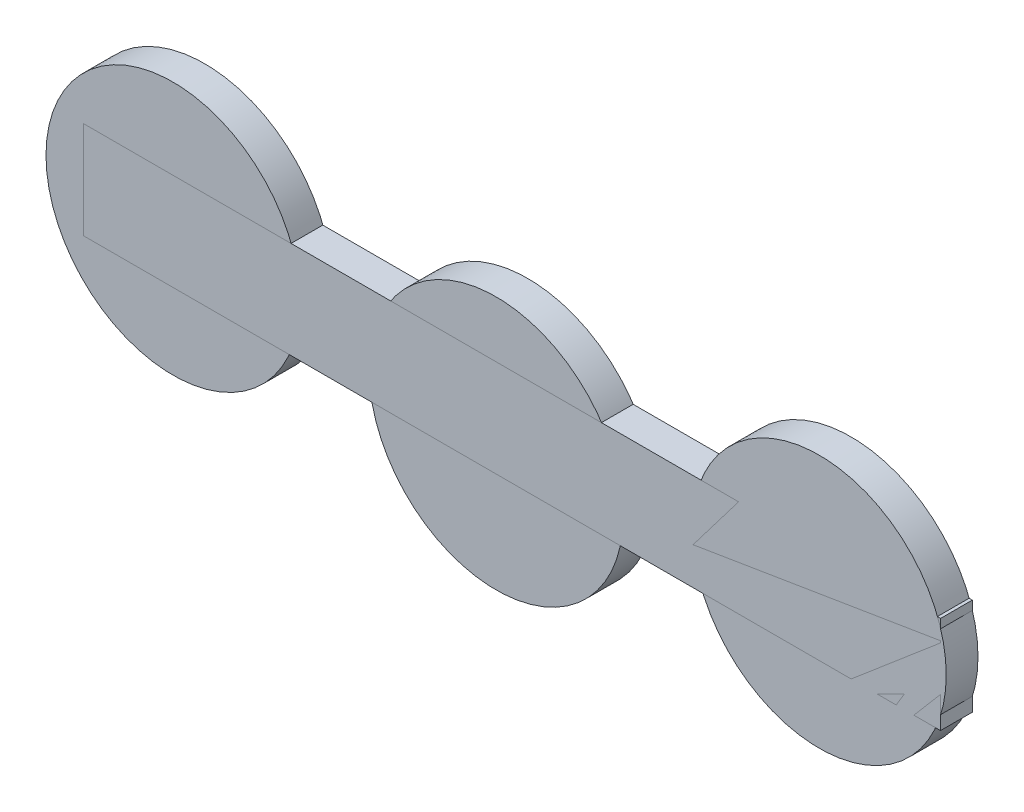
ISO-10303-21;
HEADER;
FILE_DESCRIPTION(('STEP AP214'),'2;1');
FILE_NAME('part.step','',(''),(''),'','','');
FILE_SCHEMA(('AUTOMOTIVE_DESIGN { 1 0 10303 214 1 1 1 1 }'));
ENDSEC;
DATA;
#1=APPLICATION_CONTEXT('core data for automotive mechanical design processes');
#2=APPLICATION_PROTOCOL_DEFINITION('international standard','automotive_design',2000,#1);
#3=PRODUCT_CONTEXT('',#1,'mechanical');
#4=PRODUCT('Part','Part','',(#3));
#5=PRODUCT_RELATED_PRODUCT_CATEGORY('part','',(#4));
#6=PRODUCT_DEFINITION_FORMATION('','',#4);
#7=PRODUCT_DEFINITION_CONTEXT('part definition',#1,'design');
#8=PRODUCT_DEFINITION('design','',#6,#7);
#9=PRODUCT_DEFINITION_SHAPE('','',#8);
#10=(LENGTH_UNIT() NAMED_UNIT(*) SI_UNIT(.MILLI.,.METRE.));
#11=(NAMED_UNIT(*) PLANE_ANGLE_UNIT() SI_UNIT($,.RADIAN.));
#12=(NAMED_UNIT(*) SI_UNIT($,.STERADIAN.) SOLID_ANGLE_UNIT());
#13=UNCERTAINTY_MEASURE_WITH_UNIT(LENGTH_MEASURE(1.E-05),#10,'distance_accuracy_value','');
#14=(GEOMETRIC_REPRESENTATION_CONTEXT(3) GLOBAL_UNCERTAINTY_ASSIGNED_CONTEXT((#13)) GLOBAL_UNIT_ASSIGNED_CONTEXT((#10,
#11,#12)) REPRESENTATION_CONTEXT('',''));
#15=CARTESIAN_POINT('',(0.,0.,0.));
#16=DIRECTION('',(0.,0.,1.));
#17=DIRECTION('',(1.,0.,0.));
#18=AXIS2_PLACEMENT_3D('',#15,#16,#17);
#19=CARTESIAN_POINT('',(-0.762000000000318,-81.1529999999999,25.4));
#20=DIRECTION('',(-1.,0.,0.));
#21=DIRECTION('',(0.,0.,1.));
#22=AXIS2_PLACEMENT_3D('',#19,#20,#21);
#23=PLANE('',#22);
#24=DIRECTION('',(0.,1.,0.));
#25=VECTOR('',#24,1.);
#26=CARTESIAN_POINT('',(-0.762000000000318,-81.1529999999999,0.));
#27=LINE('',#26,#25);
#28=CARTESIAN_POINT('',(-0.762000000000318,-81.1529999999999,0.));
#29=VERTEX_POINT('',#28);
#30=CARTESIAN_POINT('',(-0.762000000000318,-3.4289999999999,0.));
#31=VERTEX_POINT('',#30);
#32=EDGE_CURVE('E107',#29,#31,#27,.T.);
#33=ORIENTED_EDGE('',*,*,#32,.T.);
#34=DIRECTION('',(0.,0.,-1.));
#35=VECTOR('',#34,1.);
#36=CARTESIAN_POINT('',(-0.762000000000318,-3.4289999999999,25.4));
#37=LINE('',#36,#35);
#38=CARTESIAN_POINT('',(-0.762000000000318,-3.4289999999999,25.4));
#39=VERTEX_POINT('',#38);
#40=EDGE_CURVE('E12',#39,#31,#37,.T.);
#41=ORIENTED_EDGE('',*,*,#40,.F.);
#42=DIRECTION('',(0.,1.,0.));
#43=VECTOR('',#42,1.);
#44=CARTESIAN_POINT('',(-0.762000000000318,-81.1529999999999,25.4));
#45=LINE('',#44,#43);
#46=CARTESIAN_POINT('',(-0.762000000000318,-81.1529999999999,25.4));
#47=VERTEX_POINT('',#46);
#48=EDGE_CURVE('E95',#47,#39,#45,.T.);
#49=ORIENTED_EDGE('',*,*,#48,.F.);
#50=DIRECTION('',(0.,0.,-1.));
#51=VECTOR('',#50,1.);
#52=CARTESIAN_POINT('',(-0.762000000000318,-81.1529999999999,25.4));
#53=LINE('',#52,#51);
#54=EDGE_CURVE('E103',#47,#29,#53,.T.);
#55=ORIENTED_EDGE('',*,*,#54,.T.);
#56=EDGE_LOOP('',(#33,#41,#49,#55));
#57=FACE_BOUND('',#56,.T.);
#58=ADVANCED_FACE('F44',(#57),#23,.F.);
#59=CARTESIAN_POINT('',(-0.762000000000318,-3.4289999999999,25.4));
#60=DIRECTION('',(0.,-1.,0.));
#61=DIRECTION('',(1.,0.,0.));
#62=AXIS2_PLACEMENT_3D('',#59,#60,#61);
#63=PLANE('',#62);
#64=DIRECTION('',(-1.,0.,0.));
#65=VECTOR('',#64,1.);
#66=CARTESIAN_POINT('',(-0.762000000000318,-3.4289999999999,0.));
#67=LINE('',#66,#65);
#68=CARTESIAN_POINT('',(-686.562,-3.42899999999999,0.));
#69=VERTEX_POINT('',#68);
#70=EDGE_CURVE('E99',#31,#69,#67,.T.);
#71=ORIENTED_EDGE('',*,*,#70,.T.);
#72=DIRECTION('',(0.,0.,-1.));
#73=VECTOR('',#72,1.);
#74=CARTESIAN_POINT('',(-686.562,-3.42899999999999,25.4));
#75=LINE('',#74,#73);
#76=CARTESIAN_POINT('',(-686.562,-3.42899999999999,25.4));
#77=VERTEX_POINT('',#76);
#78=EDGE_CURVE('E52',#77,#69,#75,.T.);
#79=ORIENTED_EDGE('',*,*,#78,.F.);
#80=DIRECTION('',(-1.,0.,0.));
#81=VECTOR('',#80,1.);
#82=CARTESIAN_POINT('',(-0.762000000000318,-3.4289999999999,25.4));
#83=LINE('',#82,#81);
#84=EDGE_CURVE('E90',#39,#77,#83,.T.);
#85=ORIENTED_EDGE('',*,*,#84,.F.);
#86=ORIENTED_EDGE('',*,*,#40,.T.);
#87=EDGE_LOOP('',(#71,#79,#85,#86));
#88=FACE_BOUND('',#87,.T.);
#89=ADVANCED_FACE('F98',(#88),#63,.F.);
#90=CARTESIAN_POINT('',(-686.562,-81.153,25.4));
#91=DIRECTION('',(1.,0.,0.));
#92=DIRECTION('',(0.,1.,0.));
#93=AXIS2_PLACEMENT_3D('',#90,#91,#92);
#94=PLANE('',#93);
#95=DIRECTION('',(0.,-1.,0.));
#96=VECTOR('',#95,1.);
#97=CARTESIAN_POINT('',(-686.562,-81.153,0.));
#98=LINE('',#97,#96);
#99=CARTESIAN_POINT('',(-686.562,-81.153,0.));
#100=VERTEX_POINT('',#99);
#101=EDGE_CURVE('E77',#69,#100,#98,.T.);
#102=ORIENTED_EDGE('',*,*,#101,.T.);
#103=DIRECTION('',(0.,0.,-1.));
#104=VECTOR('',#103,1.);
#105=CARTESIAN_POINT('',(-686.562,-81.153,25.4));
#106=LINE('',#105,#104);
#107=CARTESIAN_POINT('',(-686.562,-81.153,25.4));
#108=VERTEX_POINT('',#107);
#109=EDGE_CURVE('E100',#108,#100,#106,.T.);
#110=ORIENTED_EDGE('',*,*,#109,.F.);
#111=DIRECTION('',(0.,-1.,0.));
#112=VECTOR('',#111,1.);
#113=CARTESIAN_POINT('',(-686.562,-81.153,25.4));
#114=LINE('',#113,#112);
#115=EDGE_CURVE('E93',#77,#108,#114,.T.);
#116=ORIENTED_EDGE('',*,*,#115,.F.);
#117=ORIENTED_EDGE('',*,*,#78,.T.);
#118=EDGE_LOOP('',(#102,#110,#116,#117));
#119=FACE_BOUND('',#118,.T.);
#120=ADVANCED_FACE('F101',(#119),#94,.F.);
#121=CARTESIAN_POINT('',(-0.762000000000318,-81.1529999999999,25.4));
#122=DIRECTION('',(0.,1.,0.));
#123=DIRECTION('',(-1.,0.,0.));
#124=AXIS2_PLACEMENT_3D('',#121,#122,#123);
#125=PLANE('',#124);
#126=DIRECTION('',(1.,0.,0.));
#127=VECTOR('',#126,1.);
#128=CARTESIAN_POINT('',(-0.762000000000318,-81.1529999999999,0.));
#129=LINE('',#128,#127);
#130=EDGE_CURVE('E83',#100,#29,#129,.T.);
#131=ORIENTED_EDGE('',*,*,#130,.T.);
#132=ORIENTED_EDGE('',*,*,#54,.F.);
#133=DIRECTION('',(1.,0.,0.));
#134=VECTOR('',#133,1.);
#135=CARTESIAN_POINT('',(-0.762000000000318,-81.1529999999999,25.4));
#136=LINE('',#135,#134);
#137=EDGE_CURVE('E60',#108,#47,#136,.T.);
#138=ORIENTED_EDGE('',*,*,#137,.F.);
#139=ORIENTED_EDGE('',*,*,#109,.T.);
#140=EDGE_LOOP('',(#131,#132,#138,#139));
#141=FACE_BOUND('',#140,.T.);
#142=ADVANCED_FACE('F114',(#141),#125,.F.);
#143=CARTESIAN_POINT('',(0.,0.,25.4));
#144=DIRECTION('',(0.,0.,1.));
#145=DIRECTION('',(1.,0.,0.));
#146=AXIS2_PLACEMENT_3D('',#143,#144,#145);
#147=PLANE('',#146);
#148=ORIENTED_EDGE('',*,*,#48,.T.);
#149=ORIENTED_EDGE('',*,*,#84,.T.);
#150=ORIENTED_EDGE('',*,*,#115,.T.);
#151=ORIENTED_EDGE('',*,*,#137,.T.);
#152=EDGE_LOOP('',(#148,#149,#150,#151));
#153=FACE_BOUND('',#152,.T.);
#154=ADVANCED_FACE('F91',(#153),#147,.T.);
#155=CARTESIAN_POINT('',(0.,0.,0.));
#156=DIRECTION('',(0.,0.,1.));
#157=DIRECTION('',(1.,0.,0.));
#158=AXIS2_PLACEMENT_3D('',#155,#156,#157);
#159=PLANE('',#158);
#160=ORIENTED_EDGE('',*,*,#32,.F.);
#161=ORIENTED_EDGE('',*,*,#130,.F.);
#162=ORIENTED_EDGE('',*,*,#101,.F.);
#163=ORIENTED_EDGE('',*,*,#70,.F.);
#164=EDGE_LOOP('',(#160,#161,#162,#163));
#165=FACE_BOUND('',#164,.T.);
#166=ADVANCED_FACE('F117',(#165),#159,.F.);
#167=CLOSED_SHELL('',(#58,#89,#120,#142,#154,#166));
#168=MANIFOLD_SOLID_BREP('B2',#167);
#169=CARTESIAN_POINT('',(-614.932837167686,-40.3859999999998,25.4));
#170=DIRECTION('',(0.,0.,-1.));
#171=DIRECTION('',(-1.,0.,0.));
#172=AXIS2_PLACEMENT_3D('',#169,#170,#171);
#173=CYLINDRICAL_SURFACE('',#172,101.6);
#174=CARTESIAN_POINT('',(-614.932837167686,-40.3859999999998,25.4));
#175=DIRECTION('',(0.,0.,1.));
#176=DIRECTION('',(1.,0.,0.));
#177=AXIS2_PLACEMENT_3D('',#174,#175,#176);
#178=CIRCLE('',#177,101.6);
#179=CARTESIAN_POINT('',(-513.332837167686,-40.3859999999998,25.4));
#180=VERTEX_POINT('',#179);
#181=EDGE_CURVE('E43',#180,#180,#178,.T.);
#182=ORIENTED_EDGE('',*,*,#181,.F.);
#183=EDGE_LOOP('',(#182));
#184=FACE_BOUND('',#183,.T.);
#185=CARTESIAN_POINT('',(-614.932837167686,-40.3859999999998,0.));
#186=DIRECTION('',(0.,0.,1.));
#187=DIRECTION('',(1.,0.,0.));
#188=AXIS2_PLACEMENT_3D('',#185,#186,#187);
#189=CIRCLE('',#188,101.6);
#190=CARTESIAN_POINT('',(-513.332837167686,-40.3859999999998,0.));
#191=VERTEX_POINT('',#190);
#192=EDGE_CURVE('E179',#191,#191,#189,.T.);
#193=ORIENTED_EDGE('',*,*,#192,.T.);
#194=EDGE_LOOP('',(#193));
#195=FACE_BOUND('',#194,.T.);
#196=ADVANCED_FACE('F176',(#184,#195),#173,.T.);
#197=CARTESIAN_POINT('',(-614.932837167686,-40.3859999999998,25.4));
#198=DIRECTION('',(0.,0.,1.));
#199=DIRECTION('',(1.,0.,0.));
#200=AXIS2_PLACEMENT_3D('',#197,#198,#199);
#201=PLANE('',#200);
#202=ORIENTED_EDGE('',*,*,#181,.T.);
#203=EDGE_LOOP('',(#202));
#204=FACE_BOUND('',#203,.T.);
#205=ADVANCED_FACE('F191',(#204),#201,.T.);
#206=CARTESIAN_POINT('',(-614.932837167686,-40.3859999999998,0.));
#207=DIRECTION('',(0.,0.,1.));
#208=DIRECTION('',(1.,0.,0.));
#209=AXIS2_PLACEMENT_3D('',#206,#207,#208);
#210=PLANE('',#209);
#211=ORIENTED_EDGE('',*,*,#192,.F.);
#212=EDGE_LOOP('',(#211));
#213=FACE_BOUND('',#212,.T.);
#214=ADVANCED_FACE('F189',(#213),#210,.F.);
#215=CLOSED_SHELL('',(#196,#205,#214));
#216=MANIFOLD_SOLID_BREP('B6',#215);
#217=CARTESIAN_POINT('',(-356.362,-59.9439999999998,25.4));
#218=DIRECTION('',(0.,0.,-1.));
#219=DIRECTION('',(-1.,0.,0.));
#220=AXIS2_PLACEMENT_3D('',#217,#218,#219);
#221=CYLINDRICAL_SURFACE('',#220,101.6);
#222=CARTESIAN_POINT('',(-356.362,-59.9439999999998,25.4));
#223=DIRECTION('',(0.,0.,1.));
#224=DIRECTION('',(1.,0.,0.));
#225=AXIS2_PLACEMENT_3D('',#222,#223,#224);
#226=CIRCLE('',#225,101.6);
#227=CARTESIAN_POINT('',(-254.762,-59.9439999999998,25.4));
#228=VERTEX_POINT('',#227);
#229=EDGE_CURVE('E175',#228,#228,#226,.T.);
#230=ORIENTED_EDGE('',*,*,#229,.F.);
#231=EDGE_LOOP('',(#230));
#232=FACE_BOUND('',#231,.T.);
#233=CARTESIAN_POINT('',(-356.362,-59.9439999999998,0.));
#234=DIRECTION('',(0.,0.,1.));
#235=DIRECTION('',(1.,0.,0.));
#236=AXIS2_PLACEMENT_3D('',#233,#234,#235);
#237=CIRCLE('',#236,101.6);
#238=CARTESIAN_POINT('',(-254.762,-59.9439999999998,0.));
#239=VERTEX_POINT('',#238);
#240=EDGE_CURVE('E227',#239,#239,#237,.T.);
#241=ORIENTED_EDGE('',*,*,#240,.T.);
#242=EDGE_LOOP('',(#241));
#243=FACE_BOUND('',#242,.T.);
#244=ADVANCED_FACE('F224',(#232,#243),#221,.T.);
#245=CARTESIAN_POINT('',(-356.362,-59.9439999999998,25.4));
#246=DIRECTION('',(0.,0.,1.));
#247=DIRECTION('',(1.,0.,0.));
#248=AXIS2_PLACEMENT_3D('',#245,#246,#247);
#249=PLANE('',#248);
#250=ORIENTED_EDGE('',*,*,#229,.T.);
#251=EDGE_LOOP('',(#250));
#252=FACE_BOUND('',#251,.T.);
#253=ADVANCED_FACE('F239',(#252),#249,.T.);
#254=CARTESIAN_POINT('',(-356.362,-59.9439999999998,0.));
#255=DIRECTION('',(0.,0.,1.));
#256=DIRECTION('',(1.,0.,0.));
#257=AXIS2_PLACEMENT_3D('',#254,#255,#256);
#258=PLANE('',#257);
#259=ORIENTED_EDGE('',*,*,#240,.F.);
#260=EDGE_LOOP('',(#259));
#261=FACE_BOUND('',#260,.T.);
#262=ADVANCED_FACE('F237',(#261),#258,.F.);
#263=CLOSED_SHELL('',(#244,#253,#262));
#264=MANIFOLD_SOLID_BREP('B38',#263);
#265=CARTESIAN_POINT('',(-97.7911628323145,-40.3859999999999,25.4));
#266=DIRECTION('',(0.,0.,-1.));
#267=DIRECTION('',(-1.,0.,0.));
#268=AXIS2_PLACEMENT_3D('',#265,#266,#267);
#269=CYLINDRICAL_SURFACE('',#268,101.6);
#270=CARTESIAN_POINT('',(-97.7911628323145,-40.3859999999999,25.4));
#271=DIRECTION('',(0.,0.,1.));
#272=DIRECTION('',(1.,0.,0.));
#273=AXIS2_PLACEMENT_3D('',#270,#271,#272);
#274=CIRCLE('',#273,101.6);
#275=CARTESIAN_POINT('',(3.80883716768551,-40.3859999999999,25.4));
#276=VERTEX_POINT('',#275);
#277=EDGE_CURVE('E223',#276,#276,#274,.T.);
#278=ORIENTED_EDGE('',*,*,#277,.F.);
#279=EDGE_LOOP('',(#278));
#280=FACE_BOUND('',#279,.T.);
#281=CARTESIAN_POINT('',(-97.7911628323145,-40.3859999999999,0.));
#282=DIRECTION('',(0.,0.,1.));
#283=DIRECTION('',(1.,0.,0.));
#284=AXIS2_PLACEMENT_3D('',#281,#282,#283);
#285=CIRCLE('',#284,101.6);
#286=CARTESIAN_POINT('',(3.80883716768551,-40.3859999999999,0.));
#287=VERTEX_POINT('',#286);
#288=EDGE_CURVE('E268',#287,#287,#285,.T.);
#289=ORIENTED_EDGE('',*,*,#288,.T.);
#290=EDGE_LOOP('',(#289));
#291=FACE_BOUND('',#290,.T.);
#292=ADVANCED_FACE('F265',(#280,#291),#269,.T.);
#293=CARTESIAN_POINT('',(-97.7911628323145,-40.3859999999999,25.4));
#294=DIRECTION('',(0.,0.,1.));
#295=DIRECTION('',(1.,0.,0.));
#296=AXIS2_PLACEMENT_3D('',#293,#294,#295);
#297=PLANE('',#296);
#298=ORIENTED_EDGE('',*,*,#277,.T.);
#299=EDGE_LOOP('',(#298));
#300=FACE_BOUND('',#299,.T.);
#301=ADVANCED_FACE('F280',(#300),#297,.T.);
#302=CARTESIAN_POINT('',(-97.7911628323145,-40.3859999999999,0.));
#303=DIRECTION('',(0.,0.,1.));
#304=DIRECTION('',(1.,0.,0.));
#305=AXIS2_PLACEMENT_3D('',#302,#303,#304);
#306=PLANE('',#305);
#307=ORIENTED_EDGE('',*,*,#288,.F.);
#308=EDGE_LOOP('',(#307));
#309=FACE_BOUND('',#308,.T.);
#310=ADVANCED_FACE('F278',(#309),#306,.F.);
#311=CLOSED_SHELL('',(#292,#301,#310));
#312=MANIFOLD_SOLID_BREP('B170',#311);
#313=ADVANCED_BREP_SHAPE_REPRESENTATION('',(#18,#168,#216,#264,#312),#14);
#314=SHAPE_DEFINITION_REPRESENTATION(#9,#313);
ENDSEC;
END-ISO-10303-21;
